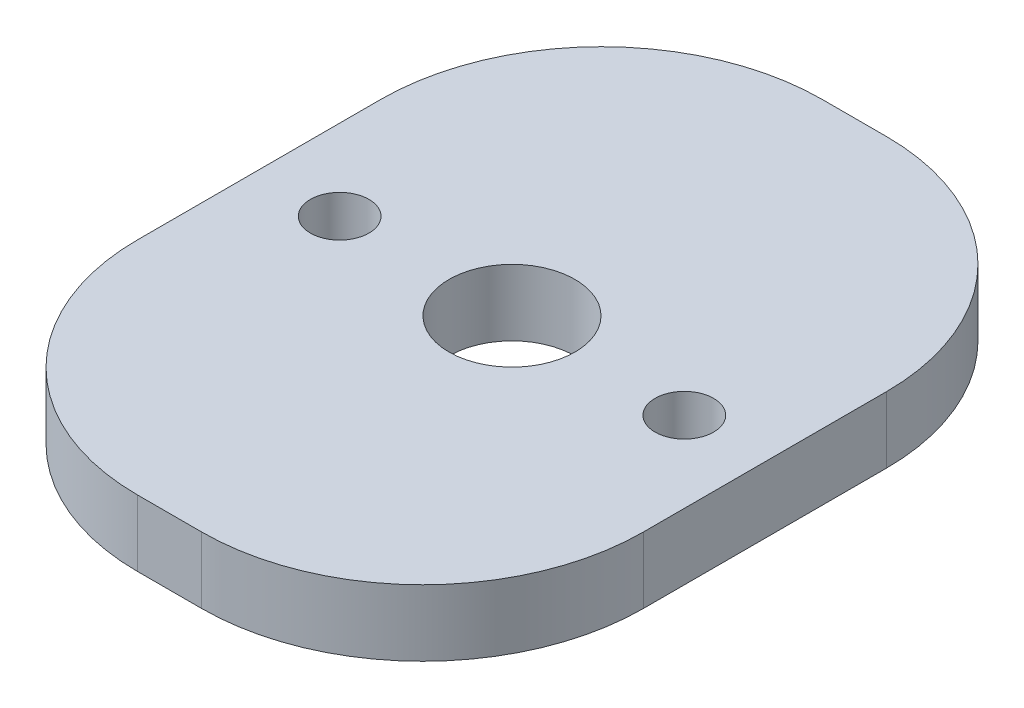
ISO-10303-21;
HEADER;
FILE_DESCRIPTION(('STEP AP214'),'2;1');
FILE_NAME('part.step','',(''),(''),'','','');
FILE_SCHEMA(('AUTOMOTIVE_DESIGN { 1 0 10303 214 1 1 1 1 }'));
ENDSEC;
DATA;
#1=APPLICATION_CONTEXT('core data for automotive mechanical design processes');
#2=APPLICATION_PROTOCOL_DEFINITION('international standard','automotive_design',2000,#1);
#3=PRODUCT_CONTEXT('',#1,'mechanical');
#4=PRODUCT('Part','Part','',(#3));
#5=PRODUCT_RELATED_PRODUCT_CATEGORY('part','',(#4));
#6=PRODUCT_DEFINITION_FORMATION('','',#4);
#7=PRODUCT_DEFINITION_CONTEXT('part definition',#1,'design');
#8=PRODUCT_DEFINITION('design','',#6,#7);
#9=PRODUCT_DEFINITION_SHAPE('','',#8);
#10=(LENGTH_UNIT() NAMED_UNIT(*) SI_UNIT(.MILLI.,.METRE.));
#11=(NAMED_UNIT(*) PLANE_ANGLE_UNIT() SI_UNIT($,.RADIAN.));
#12=(NAMED_UNIT(*) SI_UNIT($,.STERADIAN.) SOLID_ANGLE_UNIT());
#13=UNCERTAINTY_MEASURE_WITH_UNIT(LENGTH_MEASURE(1.E-05),#10,'distance_accuracy_value','');
#14=(GEOMETRIC_REPRESENTATION_CONTEXT(3) GLOBAL_UNCERTAINTY_ASSIGNED_CONTEXT((#13)) GLOBAL_UNIT_ASSIGNED_CONTEXT((#10,
#11,#12)) REPRESENTATION_CONTEXT('',''));
#15=CARTESIAN_POINT('',(0.,0.,0.));
#16=DIRECTION('',(0.,0.,1.));
#17=DIRECTION('',(1.,0.,0.));
#18=AXIS2_PLACEMENT_3D('',#15,#16,#17);
#19=CARTESIAN_POINT('',(1.45,3.,5.5));
#20=DIRECTION('',(0.,-1.,0.));
#21=DIRECTION('',(0.,0.,-1.));
#22=AXIS2_PLACEMENT_3D('',#19,#20,#21);
#23=PLANE('',#22);
#24=CARTESIAN_POINT('',(1.45,3.,5.5));
#25=DIRECTION('',(0.,1.,0.));
#26=DIRECTION('',(0.,0.,-1.));
#27=AXIS2_PLACEMENT_3D('',#24,#25,#26);
#28=CIRCLE('',#27,10.);
#29=CARTESIAN_POINT('',(1.44999999999993,3.,15.5));
#30=VERTEX_POINT('',#29);
#31=CARTESIAN_POINT('',(11.45,3.,5.49999999999993));
#32=VERTEX_POINT('',#31);
#33=EDGE_CURVE('E151',#30,#32,#28,.T.);
#34=ORIENTED_EDGE('',*,*,#33,.T.);
#35=DIRECTION('',(0.,0.,-1.));
#36=VECTOR('',#35,1.);
#37=CARTESIAN_POINT('',(11.45,3.,-5.49999999999993));
#38=LINE('',#37,#36);
#39=CARTESIAN_POINT('',(11.45,3.,-5.49999999999993));
#40=VERTEX_POINT('',#39);
#41=EDGE_CURVE('E99',#32,#40,#38,.T.);
#42=ORIENTED_EDGE('',*,*,#41,.T.);
#43=CARTESIAN_POINT('',(1.45,3.,-5.5));
#44=DIRECTION('',(0.,1.,0.));
#45=DIRECTION('',(0.,0.,-1.));
#46=AXIS2_PLACEMENT_3D('',#43,#44,#45);
#47=CIRCLE('',#46,10.);
#48=CARTESIAN_POINT('',(1.44999999999993,3.,-15.5));
#49=VERTEX_POINT('',#48);
#50=EDGE_CURVE('E166',#40,#49,#47,.T.);
#51=ORIENTED_EDGE('',*,*,#50,.T.);
#52=DIRECTION('',(-1.,0.,0.));
#53=VECTOR('',#52,1.);
#54=CARTESIAN_POINT('',(-1.44999999999993,3.,-15.5));
#55=LINE('',#54,#53);
#56=CARTESIAN_POINT('',(-1.44999999999993,3.,-15.5));
#57=VERTEX_POINT('',#56);
#58=EDGE_CURVE('E179',#49,#57,#55,.T.);
#59=ORIENTED_EDGE('',*,*,#58,.T.);
#60=CARTESIAN_POINT('',(-1.45,3.,-5.5));
#61=DIRECTION('',(0.,1.,0.));
#62=DIRECTION('',(0.,0.,1.));
#63=AXIS2_PLACEMENT_3D('',#60,#61,#62);
#64=CIRCLE('',#63,10.);
#65=CARTESIAN_POINT('',(-11.45,3.,-5.49999999999993));
#66=VERTEX_POINT('',#65);
#67=EDGE_CURVE('E118',#57,#66,#64,.T.);
#68=ORIENTED_EDGE('',*,*,#67,.T.);
#69=DIRECTION('',(0.,0.,1.));
#70=VECTOR('',#69,1.);
#71=CARTESIAN_POINT('',(-11.45,3.,-5.49999999999993));
#72=LINE('',#71,#70);
#73=CARTESIAN_POINT('',(-11.45,3.,5.49999999999993));
#74=VERTEX_POINT('',#73);
#75=EDGE_CURVE('E112',#66,#74,#72,.T.);
#76=ORIENTED_EDGE('',*,*,#75,.T.);
#77=CARTESIAN_POINT('',(-1.45,3.,5.5));
#78=DIRECTION('',(0.,1.,0.));
#79=DIRECTION('',(0.,0.,-1.));
#80=AXIS2_PLACEMENT_3D('',#77,#78,#79);
#81=CIRCLE('',#80,10.);
#82=CARTESIAN_POINT('',(-1.44999999999993,3.,15.5));
#83=VERTEX_POINT('',#82);
#84=EDGE_CURVE('E116',#74,#83,#81,.T.);
#85=ORIENTED_EDGE('',*,*,#84,.T.);
#86=DIRECTION('',(1.,0.,0.));
#87=VECTOR('',#86,1.);
#88=CARTESIAN_POINT('',(-1.44999999999993,3.,15.5));
#89=LINE('',#88,#87);
#90=EDGE_CURVE('E56',#83,#30,#89,.T.);
#91=ORIENTED_EDGE('',*,*,#90,.T.);
#92=EDGE_LOOP('',(#34,#42,#51,#59,#68,#76,#85,#91));
#93=FACE_BOUND('',#92,.T.);
#94=CARTESIAN_POINT('',(7.8,3.,0.));
#95=DIRECTION('',(0.,1.,0.));
#96=DIRECTION('',(0.,0.,1.));
#97=AXIS2_PLACEMENT_3D('',#94,#95,#96);
#98=CIRCLE('',#97,1.325);
#99=CARTESIAN_POINT('',(7.8,3.,1.325));
#100=VERTEX_POINT('',#99);
#101=EDGE_CURVE('E140',#100,#100,#98,.T.);
#102=ORIENTED_EDGE('',*,*,#101,.F.);
#103=EDGE_LOOP('',(#102));
#104=FACE_BOUND('',#103,.T.);
#105=CARTESIAN_POINT('',(-7.8,3.,0.));
#106=DIRECTION('',(0.,1.,0.));
#107=DIRECTION('',(0.,0.,1.));
#108=AXIS2_PLACEMENT_3D('',#105,#106,#107);
#109=CIRCLE('',#108,1.325);
#110=CARTESIAN_POINT('',(-7.8,3.,1.325));
#111=VERTEX_POINT('',#110);
#112=EDGE_CURVE('E188',#111,#111,#109,.T.);
#113=ORIENTED_EDGE('',*,*,#112,.F.);
#114=EDGE_LOOP('',(#113));
#115=FACE_BOUND('',#114,.T.);
#116=CARTESIAN_POINT('',(0.,3.,0.));
#117=DIRECTION('',(0.,1.,0.));
#118=DIRECTION('',(0.,0.,1.));
#119=AXIS2_PLACEMENT_3D('',#116,#117,#118);
#120=CIRCLE('',#119,2.85);
#121=CARTESIAN_POINT('',(0.,3.,2.85));
#122=VERTEX_POINT('',#121);
#123=EDGE_CURVE('E194',#122,#122,#120,.T.);
#124=ORIENTED_EDGE('',*,*,#123,.F.);
#125=EDGE_LOOP('',(#124));
#126=FACE_BOUND('',#125,.T.);
#127=ADVANCED_FACE('F39',(#93,#104,#115,#126),#23,.F.);
#128=CARTESIAN_POINT('',(1.45,0.,5.5));
#129=DIRECTION('',(0.,-1.,0.));
#130=DIRECTION('',(0.,0.,-1.));
#131=AXIS2_PLACEMENT_3D('',#128,#129,#130);
#132=PLANE('',#131);
#133=CARTESIAN_POINT('',(-7.8,0.,0.));
#134=DIRECTION('',(0.,1.,0.));
#135=DIRECTION('',(0.,0.,1.));
#136=AXIS2_PLACEMENT_3D('',#133,#134,#135);
#137=CIRCLE('',#136,1.325);
#138=CARTESIAN_POINT('',(-7.8,0.,1.325));
#139=VERTEX_POINT('',#138);
#140=EDGE_CURVE('E191',#139,#139,#137,.T.);
#141=ORIENTED_EDGE('',*,*,#140,.T.);
#142=EDGE_LOOP('',(#141));
#143=FACE_BOUND('',#142,.T.);
#144=CARTESIAN_POINT('',(1.45,0.,5.5));
#145=DIRECTION('',(0.,1.,0.));
#146=DIRECTION('',(0.,0.,-1.));
#147=AXIS2_PLACEMENT_3D('',#144,#145,#146);
#148=CIRCLE('',#147,10.);
#149=CARTESIAN_POINT('',(1.44999999999993,0.,15.5));
#150=VERTEX_POINT('',#149);
#151=CARTESIAN_POINT('',(11.45,0.,5.49999999999993));
#152=VERTEX_POINT('',#151);
#153=EDGE_CURVE('E136',#150,#152,#148,.T.);
#154=ORIENTED_EDGE('',*,*,#153,.F.);
#155=DIRECTION('',(1.,0.,0.));
#156=VECTOR('',#155,1.);
#157=CARTESIAN_POINT('',(-1.44999999999993,0.,15.5));
#158=LINE('',#157,#156);
#159=CARTESIAN_POINT('',(-1.44999999999993,0.,15.5));
#160=VERTEX_POINT('',#159);
#161=EDGE_CURVE('E91',#160,#150,#158,.T.);
#162=ORIENTED_EDGE('',*,*,#161,.F.);
#163=CARTESIAN_POINT('',(-1.45,0.,5.5));
#164=DIRECTION('',(0.,1.,0.));
#165=DIRECTION('',(0.,0.,-1.));
#166=AXIS2_PLACEMENT_3D('',#163,#164,#165);
#167=CIRCLE('',#166,10.);
#168=CARTESIAN_POINT('',(-11.45,0.,5.49999999999993));
#169=VERTEX_POINT('',#168);
#170=EDGE_CURVE('E85',#169,#160,#167,.T.);
#171=ORIENTED_EDGE('',*,*,#170,.F.);
#172=DIRECTION('',(0.,0.,1.));
#173=VECTOR('',#172,1.);
#174=CARTESIAN_POINT('',(-11.45,0.,-5.49999999999993));
#175=LINE('',#174,#173);
#176=CARTESIAN_POINT('',(-11.45,0.,-5.49999999999993));
#177=VERTEX_POINT('',#176);
#178=EDGE_CURVE('E126',#177,#169,#175,.T.);
#179=ORIENTED_EDGE('',*,*,#178,.F.);
#180=CARTESIAN_POINT('',(-1.45,0.,-5.5));
#181=DIRECTION('',(0.,1.,0.));
#182=DIRECTION('',(0.,0.,1.));
#183=AXIS2_PLACEMENT_3D('',#180,#181,#182);
#184=CIRCLE('',#183,10.);
#185=CARTESIAN_POINT('',(-1.44999999999993,0.,-15.5));
#186=VERTEX_POINT('',#185);
#187=EDGE_CURVE('E146',#186,#177,#184,.T.);
#188=ORIENTED_EDGE('',*,*,#187,.F.);
#189=DIRECTION('',(-1.,0.,0.));
#190=VECTOR('',#189,1.);
#191=CARTESIAN_POINT('',(-1.44999999999993,0.,-15.5));
#192=LINE('',#191,#190);
#193=CARTESIAN_POINT('',(1.44999999999993,0.,-15.5));
#194=VERTEX_POINT('',#193);
#195=EDGE_CURVE('E144',#194,#186,#192,.T.);
#196=ORIENTED_EDGE('',*,*,#195,.F.);
#197=CARTESIAN_POINT('',(1.45,0.,-5.5));
#198=DIRECTION('',(0.,1.,0.));
#199=DIRECTION('',(0.,0.,-1.));
#200=AXIS2_PLACEMENT_3D('',#197,#198,#199);
#201=CIRCLE('',#200,10.);
#202=CARTESIAN_POINT('',(11.45,0.,-5.49999999999993));
#203=VERTEX_POINT('',#202);
#204=EDGE_CURVE('E142',#203,#194,#201,.T.);
#205=ORIENTED_EDGE('',*,*,#204,.F.);
#206=DIRECTION('',(0.,0.,-1.));
#207=VECTOR('',#206,1.);
#208=CARTESIAN_POINT('',(11.45,0.,-5.49999999999993));
#209=LINE('',#208,#207);
#210=EDGE_CURVE('E139',#152,#203,#209,.T.);
#211=ORIENTED_EDGE('',*,*,#210,.F.);
#212=EDGE_LOOP('',(#154,#162,#171,#179,#188,#196,#205,#211));
#213=FACE_BOUND('',#212,.T.);
#214=CARTESIAN_POINT('',(7.8,0.,0.));
#215=DIRECTION('',(0.,1.,0.));
#216=DIRECTION('',(0.,0.,1.));
#217=AXIS2_PLACEMENT_3D('',#214,#215,#216);
#218=CIRCLE('',#217,1.325);
#219=CARTESIAN_POINT('',(7.8,0.,1.325));
#220=VERTEX_POINT('',#219);
#221=EDGE_CURVE('E185',#220,#220,#218,.T.);
#222=ORIENTED_EDGE('',*,*,#221,.T.);
#223=EDGE_LOOP('',(#222));
#224=FACE_BOUND('',#223,.T.);
#225=CARTESIAN_POINT('',(0.,0.,0.));
#226=DIRECTION('',(0.,1.,0.));
#227=DIRECTION('',(0.,0.,1.));
#228=AXIS2_PLACEMENT_3D('',#225,#226,#227);
#229=CIRCLE('',#228,2.85);
#230=CARTESIAN_POINT('',(0.,0.,2.85));
#231=VERTEX_POINT('',#230);
#232=EDGE_CURVE('E197',#231,#231,#229,.T.);
#233=ORIENTED_EDGE('',*,*,#232,.T.);
#234=EDGE_LOOP('',(#233));
#235=FACE_BOUND('',#234,.T.);
#236=ADVANCED_FACE('F170',(#143,#213,#224,#235),#132,.T.);
#237=CARTESIAN_POINT('',(1.45,3.,5.5));
#238=DIRECTION('',(0.,-1.,0.));
#239=DIRECTION('',(0.,0.,-1.));
#240=AXIS2_PLACEMENT_3D('',#237,#238,#239);
#241=CYLINDRICAL_SURFACE('',#240,10.);
#242=ORIENTED_EDGE('',*,*,#153,.T.);
#243=DIRECTION('',(0.,-1.,0.));
#244=VECTOR('',#243,1.);
#245=CARTESIAN_POINT('',(11.45,3.,5.49999999999993));
#246=LINE('',#245,#244);
#247=EDGE_CURVE('E11',#32,#152,#246,.T.);
#248=ORIENTED_EDGE('',*,*,#247,.F.);
#249=ORIENTED_EDGE('',*,*,#33,.F.);
#250=DIRECTION('',(0.,-1.,0.));
#251=VECTOR('',#250,1.);
#252=CARTESIAN_POINT('',(1.44999999999993,3.,15.5));
#253=LINE('',#252,#251);
#254=EDGE_CURVE('E132',#30,#150,#253,.T.);
#255=ORIENTED_EDGE('',*,*,#254,.T.);
#256=EDGE_LOOP('',(#242,#248,#249,#255));
#257=FACE_BOUND('',#256,.T.);
#258=ADVANCED_FACE('F41',(#257),#241,.T.);
#259=CARTESIAN_POINT('',(11.45,3.,-5.49999999999993));
#260=DIRECTION('',(-1.,0.,0.));
#261=DIRECTION('',(0.,0.,1.));
#262=AXIS2_PLACEMENT_3D('',#259,#260,#261);
#263=PLANE('',#262);
#264=ORIENTED_EDGE('',*,*,#210,.T.);
#265=DIRECTION('',(0.,-1.,0.));
#266=VECTOR('',#265,1.);
#267=CARTESIAN_POINT('',(11.45,3.,-5.49999999999993));
#268=LINE('',#267,#266);
#269=EDGE_CURVE('E48',#40,#203,#268,.T.);
#270=ORIENTED_EDGE('',*,*,#269,.F.);
#271=ORIENTED_EDGE('',*,*,#41,.F.);
#272=ORIENTED_EDGE('',*,*,#247,.T.);
#273=EDGE_LOOP('',(#264,#270,#271,#272));
#274=FACE_BOUND('',#273,.T.);
#275=ADVANCED_FACE('F229',(#274),#263,.F.);
#276=CARTESIAN_POINT('',(1.45,3.,-5.5));
#277=DIRECTION('',(0.,-1.,0.));
#278=DIRECTION('',(0.,0.,-1.));
#279=AXIS2_PLACEMENT_3D('',#276,#277,#278);
#280=CYLINDRICAL_SURFACE('',#279,10.);
#281=ORIENTED_EDGE('',*,*,#204,.T.);
#282=DIRECTION('',(0.,-1.,0.));
#283=VECTOR('',#282,1.);
#284=CARTESIAN_POINT('',(1.44999999999993,3.,-15.5));
#285=LINE('',#284,#283);
#286=EDGE_CURVE('E158',#49,#194,#285,.T.);
#287=ORIENTED_EDGE('',*,*,#286,.F.);
#288=ORIENTED_EDGE('',*,*,#50,.F.);
#289=ORIENTED_EDGE('',*,*,#269,.T.);
#290=EDGE_LOOP('',(#281,#287,#288,#289));
#291=FACE_BOUND('',#290,.T.);
#292=ADVANCED_FACE('F164',(#291),#280,.T.);
#293=CARTESIAN_POINT('',(-1.44999999999993,3.,-15.5));
#294=DIRECTION('',(0.,0.,1.));
#295=DIRECTION('',(1.,0.,0.));
#296=AXIS2_PLACEMENT_3D('',#293,#294,#295);
#297=PLANE('',#296);
#298=ORIENTED_EDGE('',*,*,#195,.T.);
#299=DIRECTION('',(0.,-1.,0.));
#300=VECTOR('',#299,1.);
#301=CARTESIAN_POINT('',(-1.44999999999993,3.,-15.5));
#302=LINE('',#301,#300);
#303=EDGE_CURVE('E155',#57,#186,#302,.T.);
#304=ORIENTED_EDGE('',*,*,#303,.F.);
#305=ORIENTED_EDGE('',*,*,#58,.F.);
#306=ORIENTED_EDGE('',*,*,#286,.T.);
#307=EDGE_LOOP('',(#298,#304,#305,#306));
#308=FACE_BOUND('',#307,.T.);
#309=ADVANCED_FACE('F175',(#308),#297,.F.);
#310=CARTESIAN_POINT('',(-1.45,3.,-5.5));
#311=DIRECTION('',(0.,-1.,0.));
#312=DIRECTION('',(0.,0.,-1.));
#313=AXIS2_PLACEMENT_3D('',#310,#311,#312);
#314=CYLINDRICAL_SURFACE('',#313,10.);
#315=ORIENTED_EDGE('',*,*,#187,.T.);
#316=DIRECTION('',(0.,-1.,0.));
#317=VECTOR('',#316,1.);
#318=CARTESIAN_POINT('',(-11.45,3.,-5.49999999999993));
#319=LINE('',#318,#317);
#320=EDGE_CURVE('E127',#66,#177,#319,.T.);
#321=ORIENTED_EDGE('',*,*,#320,.F.);
#322=ORIENTED_EDGE('',*,*,#67,.F.);
#323=ORIENTED_EDGE('',*,*,#303,.T.);
#324=EDGE_LOOP('',(#315,#321,#322,#323));
#325=FACE_BOUND('',#324,.T.);
#326=ADVANCED_FACE('F178',(#325),#314,.T.);
#327=CARTESIAN_POINT('',(-11.45,3.,-5.49999999999993));
#328=DIRECTION('',(1.,0.,0.));
#329=DIRECTION('',(0.,0.,-1.));
#330=AXIS2_PLACEMENT_3D('',#327,#328,#329);
#331=PLANE('',#330);
#332=ORIENTED_EDGE('',*,*,#178,.T.);
#333=DIRECTION('',(0.,-1.,0.));
#334=VECTOR('',#333,1.);
#335=CARTESIAN_POINT('',(-11.45,3.,5.49999999999993));
#336=LINE('',#335,#334);
#337=EDGE_CURVE('E123',#74,#169,#336,.T.);
#338=ORIENTED_EDGE('',*,*,#337,.F.);
#339=ORIENTED_EDGE('',*,*,#75,.F.);
#340=ORIENTED_EDGE('',*,*,#320,.T.);
#341=EDGE_LOOP('',(#332,#338,#339,#340));
#342=FACE_BOUND('',#341,.T.);
#343=ADVANCED_FACE('F124',(#342),#331,.F.);
#344=CARTESIAN_POINT('',(-1.45,3.,5.5));
#345=DIRECTION('',(0.,-1.,0.));
#346=DIRECTION('',(0.,0.,-1.));
#347=AXIS2_PLACEMENT_3D('',#344,#345,#346);
#348=CYLINDRICAL_SURFACE('',#347,10.);
#349=ORIENTED_EDGE('',*,*,#170,.T.);
#350=DIRECTION('',(0.,-1.,0.));
#351=VECTOR('',#350,1.);
#352=CARTESIAN_POINT('',(-1.44999999999993,3.,15.5));
#353=LINE('',#352,#351);
#354=EDGE_CURVE('E128',#83,#160,#353,.T.);
#355=ORIENTED_EDGE('',*,*,#354,.F.);
#356=ORIENTED_EDGE('',*,*,#84,.F.);
#357=ORIENTED_EDGE('',*,*,#337,.T.);
#358=EDGE_LOOP('',(#349,#355,#356,#357));
#359=FACE_BOUND('',#358,.T.);
#360=ADVANCED_FACE('F130',(#359),#348,.T.);
#361=CARTESIAN_POINT('',(-1.44999999999993,3.,15.5));
#362=DIRECTION('',(0.,0.,-1.));
#363=DIRECTION('',(-1.,0.,0.));
#364=AXIS2_PLACEMENT_3D('',#361,#362,#363);
#365=PLANE('',#364);
#366=ORIENTED_EDGE('',*,*,#161,.T.);
#367=ORIENTED_EDGE('',*,*,#254,.F.);
#368=ORIENTED_EDGE('',*,*,#90,.F.);
#369=ORIENTED_EDGE('',*,*,#354,.T.);
#370=EDGE_LOOP('',(#366,#367,#368,#369));
#371=FACE_BOUND('',#370,.T.);
#372=ADVANCED_FACE('F217',(#371),#365,.F.);
#373=CARTESIAN_POINT('',(7.8,3.,0.));
#374=DIRECTION('',(0.,-1.,0.));
#375=DIRECTION('',(0.,0.,-1.));
#376=AXIS2_PLACEMENT_3D('',#373,#374,#375);
#377=CYLINDRICAL_SURFACE('',#376,1.325);
#378=ORIENTED_EDGE('',*,*,#101,.T.);
#379=EDGE_LOOP('',(#378));
#380=FACE_BOUND('',#379,.T.);
#381=ORIENTED_EDGE('',*,*,#221,.F.);
#382=EDGE_LOOP('',(#381));
#383=FACE_BOUND('',#382,.T.);
#384=ADVANCED_FACE('F214',(#380,#383),#377,.F.);
#385=CARTESIAN_POINT('',(-7.8,3.,0.));
#386=DIRECTION('',(0.,-1.,0.));
#387=DIRECTION('',(0.,0.,-1.));
#388=AXIS2_PLACEMENT_3D('',#385,#386,#387);
#389=CYLINDRICAL_SURFACE('',#388,1.325);
#390=ORIENTED_EDGE('',*,*,#112,.T.);
#391=EDGE_LOOP('',(#390));
#392=FACE_BOUND('',#391,.T.);
#393=ORIENTED_EDGE('',*,*,#140,.F.);
#394=EDGE_LOOP('',(#393));
#395=FACE_BOUND('',#394,.T.);
#396=ADVANCED_FACE('F292',(#392,#395),#389,.F.);
#397=CARTESIAN_POINT('',(0.,3.,0.));
#398=DIRECTION('',(0.,-1.,0.));
#399=DIRECTION('',(0.,0.,-1.));
#400=AXIS2_PLACEMENT_3D('',#397,#398,#399);
#401=CYLINDRICAL_SURFACE('',#400,2.85);
#402=ORIENTED_EDGE('',*,*,#123,.T.);
#403=EDGE_LOOP('',(#402));
#404=FACE_BOUND('',#403,.T.);
#405=ORIENTED_EDGE('',*,*,#232,.F.);
#406=EDGE_LOOP('',(#405));
#407=FACE_BOUND('',#406,.T.);
#408=ADVANCED_FACE('F203',(#404,#407),#401,.F.);
#409=CLOSED_SHELL('',(#127,#236,#258,#275,#292,#309,#326,#343,#360,#372,#384,#396,#408));
#410=MANIFOLD_SOLID_BREP('B2',#409);
#411=ADVANCED_BREP_SHAPE_REPRESENTATION('',(#18,#410),#14);
#412=SHAPE_DEFINITION_REPRESENTATION(#9,#411);
ENDSEC;
END-ISO-10303-21;
